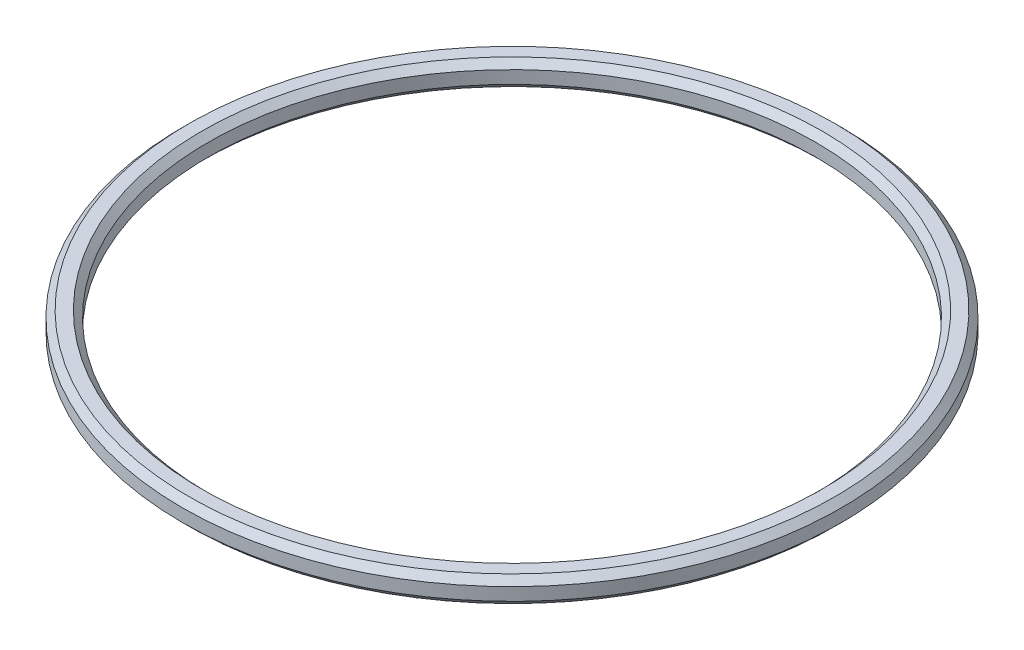
ISO-10303-21;
HEADER;
FILE_DESCRIPTION(('STEP AP214'),'2;1');
FILE_NAME('part.step','',(''),(''),'','','');
FILE_SCHEMA(('AUTOMOTIVE_DESIGN { 1 0 10303 214 1 1 1 1 }'));
ENDSEC;
DATA;
#1=APPLICATION_CONTEXT('core data for automotive mechanical design processes');
#2=APPLICATION_PROTOCOL_DEFINITION('international standard','automotive_design',2000,#1);
#3=PRODUCT_CONTEXT('',#1,'mechanical');
#4=PRODUCT('Part','Part','',(#3));
#5=PRODUCT_RELATED_PRODUCT_CATEGORY('part','',(#4));
#6=PRODUCT_DEFINITION_FORMATION('','',#4);
#7=PRODUCT_DEFINITION_CONTEXT('part definition',#1,'design');
#8=PRODUCT_DEFINITION('design','',#6,#7);
#9=PRODUCT_DEFINITION_SHAPE('','',#8);
#10=(LENGTH_UNIT() NAMED_UNIT(*) SI_UNIT(.MILLI.,.METRE.));
#11=(NAMED_UNIT(*) PLANE_ANGLE_UNIT() SI_UNIT($,.RADIAN.));
#12=(NAMED_UNIT(*) SI_UNIT($,.STERADIAN.) SOLID_ANGLE_UNIT());
#13=UNCERTAINTY_MEASURE_WITH_UNIT(LENGTH_MEASURE(1.E-05),#10,'distance_accuracy_value','');
#14=(GEOMETRIC_REPRESENTATION_CONTEXT(3) GLOBAL_UNCERTAINTY_ASSIGNED_CONTEXT((#13)) GLOBAL_UNIT_ASSIGNED_CONTEXT((#10,
#11,#12)) REPRESENTATION_CONTEXT('',''));
#15=CARTESIAN_POINT('',(0.,0.,0.));
#16=DIRECTION('',(0.,0.,1.));
#17=DIRECTION('',(1.,0.,0.));
#18=AXIS2_PLACEMENT_3D('',#15,#16,#17);
#19=CARTESIAN_POINT('',(0.,24.1,0.));
#20=DIRECTION('',(0.,-1.,0.));
#21=DIRECTION('',(0.,0.,-1.));
#22=AXIS2_PLACEMENT_3D('',#19,#20,#21);
#23=CYLINDRICAL_SURFACE('',#22,32.373);
#24=CARTESIAN_POINT('',(0.,23.465,0.));
#25=DIRECTION('',(0.,-1.,0.));
#26=DIRECTION('',(0.,0.,-1.));
#27=AXIS2_PLACEMENT_3D('',#24,#25,#26);
#28=CIRCLE('',#27,32.373);
#29=CARTESIAN_POINT('',(0.,23.465,-32.373));
#30=VERTEX_POINT('',#29);
#31=EDGE_CURVE('E62',#30,#30,#28,.T.);
#32=ORIENTED_EDGE('',*,*,#31,.T.);
#33=EDGE_LOOP('',(#32));
#34=FACE_BOUND('',#33,.T.);
#35=CARTESIAN_POINT('',(0.,22.21,0.));
#36=DIRECTION('',(0.,-1.,0.));
#37=DIRECTION('',(0.,0.,-1.));
#38=AXIS2_PLACEMENT_3D('',#35,#36,#37);
#39=CIRCLE('',#38,32.373);
#40=CARTESIAN_POINT('',(0.,22.21,-32.373));
#41=VERTEX_POINT('',#40);
#42=EDGE_CURVE('E65',#41,#41,#39,.F.);
#43=ORIENTED_EDGE('',*,*,#42,.T.);
#44=EDGE_LOOP('',(#43));
#45=FACE_BOUND('',#44,.T.);
#46=ADVANCED_FACE('F35',(#34,#45),#23,.T.);
#47=CARTESIAN_POINT('',(0.,24.1,0.));
#48=DIRECTION('',(0.,-1.,0.));
#49=DIRECTION('',(0.,0.,-1.));
#50=AXIS2_PLACEMENT_3D('',#47,#48,#49);
#51=PLANE('',#50);
#52=CARTESIAN_POINT('',(0.,24.1,0.));
#53=DIRECTION('',(0.,-1.,0.));
#54=DIRECTION('',(0.,0.,-1.));
#55=AXIS2_PLACEMENT_3D('',#52,#53,#54);
#56=CIRCLE('',#55,31.738);
#57=CARTESIAN_POINT('',(0.,24.1,-31.738));
#58=VERTEX_POINT('',#57);
#59=EDGE_CURVE('E56',#58,#58,#56,.F.);
#60=ORIENTED_EDGE('',*,*,#59,.T.);
#61=EDGE_LOOP('',(#60));
#62=FACE_BOUND('',#61,.T.);
#63=CARTESIAN_POINT('',(0.,24.1,0.));
#64=DIRECTION('',(0.,-1.,0.));
#65=DIRECTION('',(0.,0.,-1.));
#66=AXIS2_PLACEMENT_3D('',#63,#64,#65);
#67=CIRCLE('',#66,30.468);
#68=CARTESIAN_POINT('',(0.,24.1,-30.468));
#69=VERTEX_POINT('',#68);
#70=EDGE_CURVE('E59',#69,#69,#67,.T.);
#71=ORIENTED_EDGE('',*,*,#70,.T.);
#72=EDGE_LOOP('',(#71));
#73=FACE_BOUND('',#72,.T.);
#74=ADVANCED_FACE('F84',(#62,#73),#51,.F.);
#75=CARTESIAN_POINT('',(0.,21.575,0.));
#76=DIRECTION('',(0.,-1.,0.));
#77=DIRECTION('',(0.,0.,-1.));
#78=AXIS2_PLACEMENT_3D('',#75,#76,#77);
#79=PLANE('',#78);
#80=CARTESIAN_POINT('',(0.,21.575,0.));
#81=DIRECTION('',(0.,-1.,0.));
#82=DIRECTION('',(0.,0.,-1.));
#83=AXIS2_PLACEMENT_3D('',#80,#81,#82);
#84=CIRCLE('',#83,31.738);
#85=CARTESIAN_POINT('',(0.,21.575,-31.738));
#86=VERTEX_POINT('',#85);
#87=EDGE_CURVE('E10',#86,#86,#84,.T.);
#88=ORIENTED_EDGE('',*,*,#87,.T.);
#89=EDGE_LOOP('',(#88));
#90=FACE_BOUND('',#89,.T.);
#91=CARTESIAN_POINT('',(0.,21.575,0.));
#92=DIRECTION('',(0.,-1.,0.));
#93=DIRECTION('',(0.,0.,-1.));
#94=AXIS2_PLACEMENT_3D('',#91,#92,#93);
#95=CIRCLE('',#94,30.468);
#96=CARTESIAN_POINT('',(0.,21.575,-30.468));
#97=VERTEX_POINT('',#96);
#98=EDGE_CURVE('E43',#97,#97,#95,.F.);
#99=ORIENTED_EDGE('',*,*,#98,.T.);
#100=EDGE_LOOP('',(#99));
#101=FACE_BOUND('',#100,.T.);
#102=ADVANCED_FACE('F90',(#90,#101),#79,.T.);
#103=CARTESIAN_POINT('',(0.,24.1,0.));
#104=DIRECTION('',(0.,-1.,0.));
#105=DIRECTION('',(0.,0.,-1.));
#106=AXIS2_PLACEMENT_3D('',#103,#104,#105);
#107=CYLINDRICAL_SURFACE('',#106,29.833);
#108=CARTESIAN_POINT('',(0.,23.465,0.));
#109=DIRECTION('',(0.,-1.,0.));
#110=DIRECTION('',(0.,0.,-1.));
#111=AXIS2_PLACEMENT_3D('',#108,#109,#110);
#112=CIRCLE('',#111,29.833);
#113=CARTESIAN_POINT('',(0.,23.465,-29.833));
#114=VERTEX_POINT('',#113);
#115=EDGE_CURVE('E47',#114,#114,#112,.F.);
#116=ORIENTED_EDGE('',*,*,#115,.T.);
#117=EDGE_LOOP('',(#116));
#118=FACE_BOUND('',#117,.T.);
#119=CARTESIAN_POINT('',(0.,22.21,0.));
#120=DIRECTION('',(0.,-1.,0.));
#121=DIRECTION('',(0.,0.,-1.));
#122=AXIS2_PLACEMENT_3D('',#119,#120,#121);
#123=CIRCLE('',#122,29.833);
#124=CARTESIAN_POINT('',(0.,22.21,-29.833));
#125=VERTEX_POINT('',#124);
#126=EDGE_CURVE('E51',#125,#125,#123,.T.);
#127=ORIENTED_EDGE('',*,*,#126,.T.);
#128=EDGE_LOOP('',(#127));
#129=FACE_BOUND('',#128,.T.);
#130=ADVANCED_FACE('F100',(#118,#129),#107,.F.);
#131=CARTESIAN_POINT('',(0.,23.465,0.));
#132=DIRECTION('',(0.,-1.,0.));
#133=DIRECTION('',(0.,0.,-1.));
#134=AXIS2_PLACEMENT_3D('',#131,#132,#133);
#135=CONICAL_SURFACE('',#134,32.373,0.785398163397454);
#136=CARTESIAN_POINT('',(0.,24.1,-31.738));
#137=CARTESIAN_POINT('',(0.,24.0933854166667,-31.7446145833333));
#138=CARTESIAN_POINT('',(0.,24.0867708333333,-31.7512291666667));
#139=CARTESIAN_POINT('',(0.,24.0735416666667,-31.7644583333333));
#140=CARTESIAN_POINT('',(0.,24.0669270833333,-31.7710729166667));
#141=CARTESIAN_POINT('',(0.,24.0536979166667,-31.7843020833333));
#142=CARTESIAN_POINT('',(0.,24.0470833333333,-31.7909166666667));
#143=CARTESIAN_POINT('',(0.,24.0338541666667,-31.8041458333333));
#144=CARTESIAN_POINT('',(0.,24.0272395833333,-31.8107604166667));
#145=CARTESIAN_POINT('',(0.,24.0140104166667,-31.8239895833333));
#146=CARTESIAN_POINT('',(0.,24.0073958333333,-31.8306041666667));
#147=CARTESIAN_POINT('',(0.,23.9941666666667,-31.8438333333333));
#148=CARTESIAN_POINT('',(0.,23.9875520833333,-31.8504479166667));
#149=CARTESIAN_POINT('',(0.,23.9743229166667,-31.8636770833333));
#150=CARTESIAN_POINT('',(0.,23.9677083333333,-31.8702916666667));
#151=CARTESIAN_POINT('',(0.,23.9544791666667,-31.8835208333333));
#152=CARTESIAN_POINT('',(0.,23.9478645833333,-31.8901354166667));
#153=CARTESIAN_POINT('',(0.,23.9346354166667,-31.9033645833333));
#154=CARTESIAN_POINT('',(0.,23.9280208333333,-31.9099791666667));
#155=CARTESIAN_POINT('',(0.,23.9147916666667,-31.9232083333333));
#156=CARTESIAN_POINT('',(0.,23.9081770833333,-31.9298229166667));
#157=CARTESIAN_POINT('',(0.,23.8949479166667,-31.9430520833333));
#158=CARTESIAN_POINT('',(0.,23.8883333333333,-31.9496666666667));
#159=CARTESIAN_POINT('',(0.,23.8751041666667,-31.9628958333333));
#160=CARTESIAN_POINT('',(0.,23.8684895833333,-31.9695104166667));
#161=CARTESIAN_POINT('',(0.,23.8552604166667,-31.9827395833333));
#162=CARTESIAN_POINT('',(0.,23.8486458333333,-31.9893541666667));
#163=CARTESIAN_POINT('',(0.,23.8354166666667,-32.0025833333333));
#164=CARTESIAN_POINT('',(0.,23.8288020833333,-32.0091979166667));
#165=CARTESIAN_POINT('',(0.,23.8155729166667,-32.0224270833333));
#166=CARTESIAN_POINT('',(0.,23.8089583333333,-32.0290416666667));
#167=CARTESIAN_POINT('',(0.,23.7957291666667,-32.0422708333333));
#168=CARTESIAN_POINT('',(0.,23.7891145833333,-32.0488854166667));
#169=CARTESIAN_POINT('',(0.,23.7758854166667,-32.0621145833333));
#170=CARTESIAN_POINT('',(0.,23.7692708333333,-32.0687291666667));
#171=CARTESIAN_POINT('',(0.,23.7560416666667,-32.0819583333333));
#172=CARTESIAN_POINT('',(0.,23.7494270833333,-32.0885729166667));
#173=CARTESIAN_POINT('',(0.,23.7361979166667,-32.1018020833333));
#174=CARTESIAN_POINT('',(0.,23.7295833333333,-32.1084166666667));
#175=CARTESIAN_POINT('',(0.,23.7163541666667,-32.1216458333333));
#176=CARTESIAN_POINT('',(0.,23.7097395833333,-32.1282604166667));
#177=CARTESIAN_POINT('',(0.,23.6965104166667,-32.1414895833333));
#178=CARTESIAN_POINT('',(0.,23.6898958333333,-32.1481041666667));
#179=CARTESIAN_POINT('',(0.,23.6766666666667,-32.1613333333333));
#180=CARTESIAN_POINT('',(0.,23.6700520833333,-32.1679479166667));
#181=CARTESIAN_POINT('',(0.,23.6568229166667,-32.1811770833333));
#182=CARTESIAN_POINT('',(0.,23.6502083333333,-32.1877916666667));
#183=CARTESIAN_POINT('',(0.,23.6369791666667,-32.2010208333333));
#184=CARTESIAN_POINT('',(0.,23.6303645833333,-32.2076354166667));
#185=CARTESIAN_POINT('',(0.,23.6171354166667,-32.2208645833333));
#186=CARTESIAN_POINT('',(0.,23.6105208333333,-32.2274791666667));
#187=CARTESIAN_POINT('',(0.,23.5972916666667,-32.2407083333333));
#188=CARTESIAN_POINT('',(0.,23.5906770833333,-32.2473229166667));
#189=CARTESIAN_POINT('',(0.,23.5774479166667,-32.2605520833333));
#190=CARTESIAN_POINT('',(0.,23.5708333333333,-32.2671666666667));
#191=CARTESIAN_POINT('',(0.,23.5576041666667,-32.2803958333333));
#192=CARTESIAN_POINT('',(0.,23.5509895833333,-32.2870104166667));
#193=CARTESIAN_POINT('',(0.,23.5377604166667,-32.3002395833333));
#194=CARTESIAN_POINT('',(0.,23.5311458333333,-32.3068541666667));
#195=CARTESIAN_POINT('',(0.,23.5179166666667,-32.3200833333333));
#196=CARTESIAN_POINT('',(0.,23.5113020833333,-32.3266979166667));
#197=CARTESIAN_POINT('',(0.,23.4980729166667,-32.3399270833333));
#198=CARTESIAN_POINT('',(0.,23.4914583333333,-32.3465416666667));
#199=CARTESIAN_POINT('',(0.,23.4782291666667,-32.3597708333333));
#200=CARTESIAN_POINT('',(0.,23.4716145833333,-32.3663854166667));
#201=CARTESIAN_POINT('',(0.,23.465,-32.373));
#202=B_SPLINE_CURVE_WITH_KNOTS('',3,(#136,#137,#138,#139,#140,#141,#142,#143,#144,#145,#146,
#147,#148,#149,#150,#151,#152,#153,#154,#155,#156,#157,#158,#159,#160,#161,#162,#163,#164,#165,
#166,#167,#168,#169,#170,#171,#172,#173,#174,#175,#176,#177,#178,#179,#180,#181,#182,#183,#184,
#185,#186,#187,#188,#189,#190,#191,#192,#193,#194,#195,#196,#197,#198,#199,#200,#201),
.UNSPECIFIED.,.F.,.F.,(4,2,2,2,2,2,2,2,2,2,2,2,2,2,2,2,2,2,2,2,2,2,2,2,2,2,2,2,2,2,2,2,4),(0.,
0.028063300378341,0.0561266007566795,0.0841899011350204,0.112253201513364,0.140316501891702,
0.168379802270043,0.196443102648382,0.22450640302672,0.252569703405066,0.280633003783405,
0.308696304161746,0.336759604540084,0.364822904918428,0.392886205296769,0.420949505675107,
0.449012806053446,0.477076106431786,0.50513940681013,0.533202707188471,0.561266007566809,
0.589329307945148,0.617392608323494,0.645455908701832,0.67351920908017,0.701582509458512,
0.72964580983685,0.757709110215196,0.785772410593534,0.813835710971873,0.841899011350214,
0.869962311728557,0.898025612106898),.UNSPECIFIED.);
#203=EDGE_CURVE('BSEAM79',#58,#30,#202,.T.);
#204=ORIENTED_EDGE('',*,*,#59,.F.);
#205=ORIENTED_EDGE('',*,*,#31,.F.);
#206=ORIENTED_EDGE('',*,*,#203,.T.);
#207=ORIENTED_EDGE('',*,*,#203,.F.);
#208=EDGE_LOOP('',(#204,#206,#205,#207));
#209=FACE_BOUND('',#208,.T.);
#210=ADVANCED_FACE('F79',(#209),#135,.T.);
#211=CARTESIAN_POINT('',(0.,24.1,0.));
#212=DIRECTION('',(0.,1.,0.));
#213=DIRECTION('',(0.,0.,1.));
#214=AXIS2_PLACEMENT_3D('',#211,#212,#213);
#215=CONICAL_SURFACE('',#214,30.468,0.785398163397451);
#216=ORIENTED_EDGE('',*,*,#115,.F.);
#217=EDGE_LOOP('',(#216));
#218=FACE_BOUND('',#217,.T.);
#219=ORIENTED_EDGE('',*,*,#70,.F.);
#220=EDGE_LOOP('',(#219));
#221=FACE_BOUND('',#220,.T.);
#222=ADVANCED_FACE('F73',(#218,#221),#215,.F.);
#223=CARTESIAN_POINT('',(0.,21.575,0.));
#224=DIRECTION('',(0.,1.,0.));
#225=DIRECTION('',(0.,0.,1.));
#226=AXIS2_PLACEMENT_3D('',#223,#224,#225);
#227=CONICAL_SURFACE('',#226,31.738,0.785398163397448);
#228=ORIENTED_EDGE('',*,*,#42,.F.);
#229=EDGE_LOOP('',(#228));
#230=FACE_BOUND('',#229,.T.);
#231=ORIENTED_EDGE('',*,*,#87,.F.);
#232=EDGE_LOOP('',(#231));
#233=FACE_BOUND('',#232,.T.);
#234=ADVANCED_FACE('F70',(#230,#233),#227,.T.);
#235=CARTESIAN_POINT('',(0.,22.21,0.));
#236=DIRECTION('',(0.,-1.,0.));
#237=DIRECTION('',(0.,0.,-1.));
#238=AXIS2_PLACEMENT_3D('',#235,#236,#237);
#239=CONICAL_SURFACE('',#238,29.833,0.785398163397446);
#240=ORIENTED_EDGE('',*,*,#98,.F.);
#241=EDGE_LOOP('',(#240));
#242=FACE_BOUND('',#241,.T.);
#243=ORIENTED_EDGE('',*,*,#126,.F.);
#244=EDGE_LOOP('',(#243));
#245=FACE_BOUND('',#244,.T.);
#246=ADVANCED_FACE('F38',(#242,#245),#239,.F.);
#247=CLOSED_SHELL('',(#46,#74,#102,#130,#210,#222,#234,#246));
#248=MANIFOLD_SOLID_BREP('B2',#247);
#249=ADVANCED_BREP_SHAPE_REPRESENTATION('',(#18,#248),#14);
#250=SHAPE_DEFINITION_REPRESENTATION(#9,#249);
ENDSEC;
END-ISO-10303-21;
